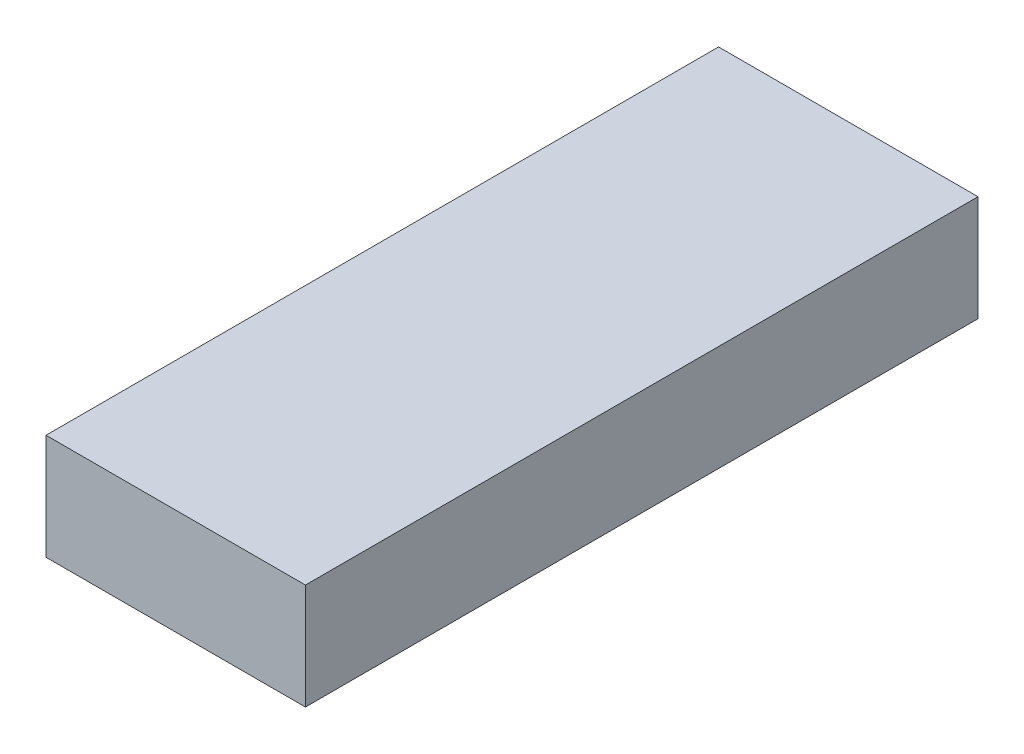
ISO-10303-21;
HEADER;
FILE_DESCRIPTION(('STEP AP214'),'2;1');
FILE_NAME('part.step','',(''),(''),'','','');
FILE_SCHEMA(('AUTOMOTIVE_DESIGN { 1 0 10303 214 1 1 1 1 }'));
ENDSEC;
DATA;
#1=APPLICATION_CONTEXT('core data for automotive mechanical design processes');
#2=APPLICATION_PROTOCOL_DEFINITION('international standard','automotive_design',2000,#1);
#3=PRODUCT_CONTEXT('',#1,'mechanical');
#4=PRODUCT('Part','Part','',(#3));
#5=PRODUCT_RELATED_PRODUCT_CATEGORY('part','',(#4));
#6=PRODUCT_DEFINITION_FORMATION('','',#4);
#7=PRODUCT_DEFINITION_CONTEXT('part definition',#1,'design');
#8=PRODUCT_DEFINITION('design','',#6,#7);
#9=PRODUCT_DEFINITION_SHAPE('','',#8);
#10=(LENGTH_UNIT() NAMED_UNIT(*) SI_UNIT(.MILLI.,.METRE.));
#11=(NAMED_UNIT(*) PLANE_ANGLE_UNIT() SI_UNIT($,.RADIAN.));
#12=(NAMED_UNIT(*) SI_UNIT($,.STERADIAN.) SOLID_ANGLE_UNIT());
#13=UNCERTAINTY_MEASURE_WITH_UNIT(LENGTH_MEASURE(1.E-05),#10,'distance_accuracy_value','');
#14=(GEOMETRIC_REPRESENTATION_CONTEXT(3) GLOBAL_UNCERTAINTY_ASSIGNED_CONTEXT((#13)) GLOBAL_UNIT_ASSIGNED_CONTEXT((#10,
#11,#12)) REPRESENTATION_CONTEXT('',''));
#15=CARTESIAN_POINT('',(0.,0.,0.));
#16=DIRECTION('',(0.,0.,1.));
#17=DIRECTION('',(1.,0.,0.));
#18=AXIS2_PLACEMENT_3D('',#15,#16,#17);
#19=CARTESIAN_POINT('',(-13.5,11.,-35.));
#20=DIRECTION('',(1.,0.,0.));
#21=DIRECTION('',(0.,0.,-1.));
#22=AXIS2_PLACEMENT_3D('',#19,#20,#21);
#23=PLANE('',#22);
#24=DIRECTION('',(0.,0.,1.));
#25=VECTOR('',#24,1.);
#26=CARTESIAN_POINT('',(-13.5,0.,-35.));
#27=LINE('',#26,#25);
#28=CARTESIAN_POINT('',(-13.5,0.,-35.));
#29=VERTEX_POINT('',#28);
#30=CARTESIAN_POINT('',(-13.5,0.,35.));
#31=VERTEX_POINT('',#30);
#32=EDGE_CURVE('E95',#29,#31,#27,.T.);
#33=ORIENTED_EDGE('',*,*,#32,.T.);
#34=DIRECTION('',(0.,-1.,0.));
#35=VECTOR('',#34,1.);
#36=CARTESIAN_POINT('',(-13.5,11.,35.));
#37=LINE('',#36,#35);
#38=CARTESIAN_POINT('',(-13.5,11.,35.));
#39=VERTEX_POINT('',#38);
#40=EDGE_CURVE('E11',#39,#31,#37,.T.);
#41=ORIENTED_EDGE('',*,*,#40,.F.);
#42=DIRECTION('',(0.,0.,1.));
#43=VECTOR('',#42,1.);
#44=CARTESIAN_POINT('',(-13.5,11.,-35.));
#45=LINE('',#44,#43);
#46=CARTESIAN_POINT('',(-13.5,11.,-35.));
#47=VERTEX_POINT('',#46);
#48=EDGE_CURVE('E83',#47,#39,#45,.T.);
#49=ORIENTED_EDGE('',*,*,#48,.F.);
#50=DIRECTION('',(0.,-1.,0.));
#51=VECTOR('',#50,1.);
#52=CARTESIAN_POINT('',(-13.5,11.,-35.));
#53=LINE('',#52,#51);
#54=EDGE_CURVE('E91',#47,#29,#53,.T.);
#55=ORIENTED_EDGE('',*,*,#54,.T.);
#56=EDGE_LOOP('',(#33,#41,#49,#55));
#57=FACE_BOUND('',#56,.T.);
#58=ADVANCED_FACE('F32',(#57),#23,.F.);
#59=CARTESIAN_POINT('',(-13.5,11.,35.));
#60=DIRECTION('',(0.,0.,-1.));
#61=DIRECTION('',(-1.,0.,0.));
#62=AXIS2_PLACEMENT_3D('',#59,#60,#61);
#63=PLANE('',#62);
#64=DIRECTION('',(1.,0.,0.));
#65=VECTOR('',#64,1.);
#66=CARTESIAN_POINT('',(-13.5,0.,35.));
#67=LINE('',#66,#65);
#68=CARTESIAN_POINT('',(13.5,0.,35.));
#69=VERTEX_POINT('',#68);
#70=EDGE_CURVE('E87',#31,#69,#67,.T.);
#71=ORIENTED_EDGE('',*,*,#70,.T.);
#72=DIRECTION('',(0.,-1.,0.));
#73=VECTOR('',#72,1.);
#74=CARTESIAN_POINT('',(13.5,11.,35.));
#75=LINE('',#74,#73);
#76=CARTESIAN_POINT('',(13.5,11.,35.));
#77=VERTEX_POINT('',#76);
#78=EDGE_CURVE('E40',#77,#69,#75,.T.);
#79=ORIENTED_EDGE('',*,*,#78,.F.);
#80=DIRECTION('',(1.,0.,0.));
#81=VECTOR('',#80,1.);
#82=CARTESIAN_POINT('',(-13.5,11.,35.));
#83=LINE('',#82,#81);
#84=EDGE_CURVE('E78',#39,#77,#83,.T.);
#85=ORIENTED_EDGE('',*,*,#84,.F.);
#86=ORIENTED_EDGE('',*,*,#40,.T.);
#87=EDGE_LOOP('',(#71,#79,#85,#86));
#88=FACE_BOUND('',#87,.T.);
#89=ADVANCED_FACE('F86',(#88),#63,.F.);
#90=CARTESIAN_POINT('',(13.5,11.,-35.));
#91=DIRECTION('',(-1.,0.,0.));
#92=DIRECTION('',(0.,0.,1.));
#93=AXIS2_PLACEMENT_3D('',#90,#91,#92);
#94=PLANE('',#93);
#95=DIRECTION('',(0.,0.,-1.));
#96=VECTOR('',#95,1.);
#97=CARTESIAN_POINT('',(13.5,0.,-35.));
#98=LINE('',#97,#96);
#99=CARTESIAN_POINT('',(13.5,0.,-35.));
#100=VERTEX_POINT('',#99);
#101=EDGE_CURVE('E65',#69,#100,#98,.T.);
#102=ORIENTED_EDGE('',*,*,#101,.T.);
#103=DIRECTION('',(0.,-1.,0.));
#104=VECTOR('',#103,1.);
#105=CARTESIAN_POINT('',(13.5,11.,-35.));
#106=LINE('',#105,#104);
#107=CARTESIAN_POINT('',(13.5,11.,-35.));
#108=VERTEX_POINT('',#107);
#109=EDGE_CURVE('E88',#108,#100,#106,.T.);
#110=ORIENTED_EDGE('',*,*,#109,.F.);
#111=DIRECTION('',(0.,0.,-1.));
#112=VECTOR('',#111,1.);
#113=CARTESIAN_POINT('',(13.5,11.,-35.));
#114=LINE('',#113,#112);
#115=EDGE_CURVE('E81',#77,#108,#114,.T.);
#116=ORIENTED_EDGE('',*,*,#115,.F.);
#117=ORIENTED_EDGE('',*,*,#78,.T.);
#118=EDGE_LOOP('',(#102,#110,#116,#117));
#119=FACE_BOUND('',#118,.T.);
#120=ADVANCED_FACE('F89',(#119),#94,.F.);
#121=CARTESIAN_POINT('',(-13.5,11.,-35.));
#122=DIRECTION('',(0.,0.,1.));
#123=DIRECTION('',(1.,0.,0.));
#124=AXIS2_PLACEMENT_3D('',#121,#122,#123);
#125=PLANE('',#124);
#126=DIRECTION('',(-1.,0.,0.));
#127=VECTOR('',#126,1.);
#128=CARTESIAN_POINT('',(-13.5,0.,-35.));
#129=LINE('',#128,#127);
#130=EDGE_CURVE('E71',#100,#29,#129,.T.);
#131=ORIENTED_EDGE('',*,*,#130,.T.);
#132=ORIENTED_EDGE('',*,*,#54,.F.);
#133=DIRECTION('',(-1.,0.,0.));
#134=VECTOR('',#133,1.);
#135=CARTESIAN_POINT('',(-13.5,11.,-35.));
#136=LINE('',#135,#134);
#137=EDGE_CURVE('E48',#108,#47,#136,.T.);
#138=ORIENTED_EDGE('',*,*,#137,.F.);
#139=ORIENTED_EDGE('',*,*,#109,.T.);
#140=EDGE_LOOP('',(#131,#132,#138,#139));
#141=FACE_BOUND('',#140,.T.);
#142=ADVANCED_FACE('F102',(#141),#125,.F.);
#143=CARTESIAN_POINT('',(0.,11.,0.));
#144=DIRECTION('',(0.,1.,0.));
#145=DIRECTION('',(0.,0.,1.));
#146=AXIS2_PLACEMENT_3D('',#143,#144,#145);
#147=PLANE('',#146);
#148=ORIENTED_EDGE('',*,*,#48,.T.);
#149=ORIENTED_EDGE('',*,*,#84,.T.);
#150=ORIENTED_EDGE('',*,*,#115,.T.);
#151=ORIENTED_EDGE('',*,*,#137,.T.);
#152=EDGE_LOOP('',(#148,#149,#150,#151));
#153=FACE_BOUND('',#152,.T.);
#154=ADVANCED_FACE('F79',(#153),#147,.T.);
#155=CARTESIAN_POINT('',(0.,0.,0.));
#156=DIRECTION('',(0.,1.,0.));
#157=DIRECTION('',(0.,0.,1.));
#158=AXIS2_PLACEMENT_3D('',#155,#156,#157);
#159=PLANE('',#158);
#160=ORIENTED_EDGE('',*,*,#32,.F.);
#161=ORIENTED_EDGE('',*,*,#130,.F.);
#162=ORIENTED_EDGE('',*,*,#101,.F.);
#163=ORIENTED_EDGE('',*,*,#70,.F.);
#164=EDGE_LOOP('',(#160,#161,#162,#163));
#165=FACE_BOUND('',#164,.T.);
#166=ADVANCED_FACE('F105',(#165),#159,.F.);
#167=CLOSED_SHELL('',(#58,#89,#120,#142,#154,#166));
#168=MANIFOLD_SOLID_BREP('B2',#167);
#169=ADVANCED_BREP_SHAPE_REPRESENTATION('',(#18,#168),#14);
#170=SHAPE_DEFINITION_REPRESENTATION(#9,#169);
ENDSEC;
END-ISO-10303-21;
